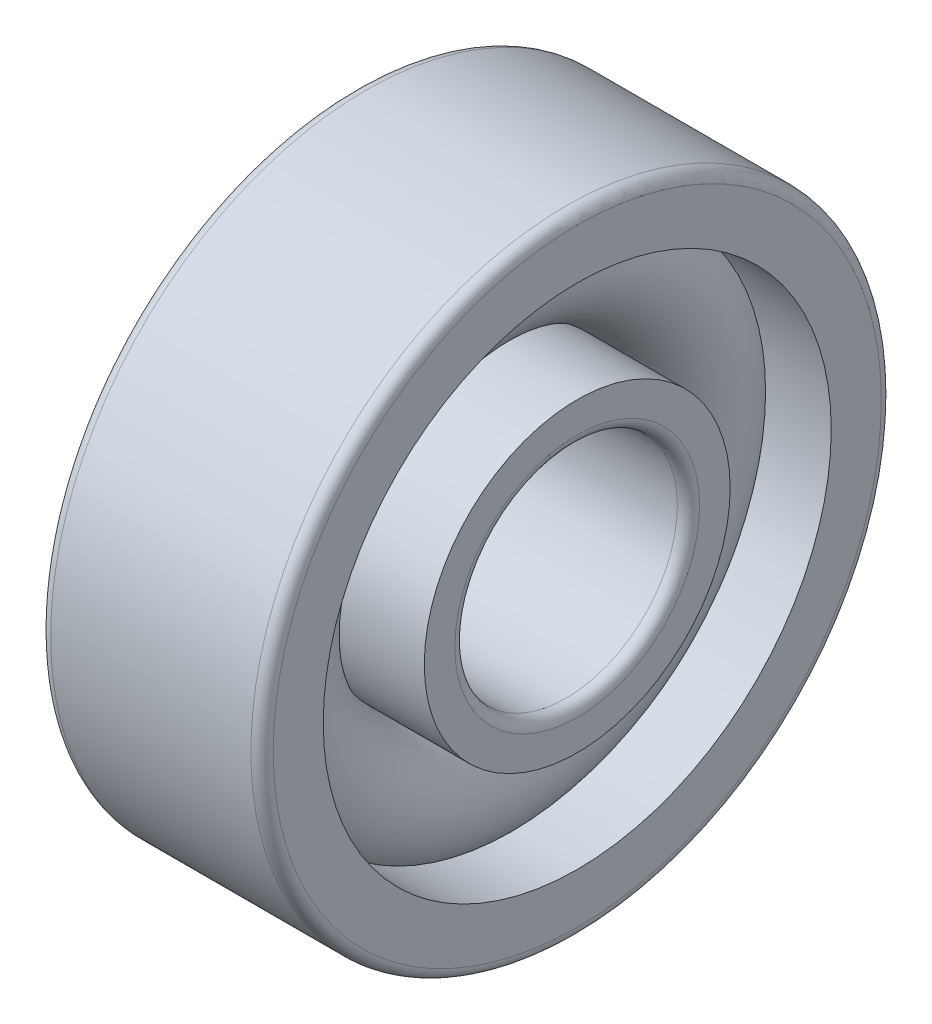
ISO-10303-21;
HEADER;
FILE_DESCRIPTION(('STEP AP214'),'2;1');
FILE_NAME('part.step','',(''),(''),'','','');
FILE_SCHEMA(('AUTOMOTIVE_DESIGN { 1 0 10303 214 1 1 1 1 }'));
ENDSEC;
DATA;
#1=APPLICATION_CONTEXT('core data for automotive mechanical design processes');
#2=APPLICATION_PROTOCOL_DEFINITION('international standard','automotive_design',2000,#1);
#3=PRODUCT_CONTEXT('',#1,'mechanical');
#4=PRODUCT('Part','Part','',(#3));
#5=PRODUCT_RELATED_PRODUCT_CATEGORY('part','',(#4));
#6=PRODUCT_DEFINITION_FORMATION('','',#4);
#7=PRODUCT_DEFINITION_CONTEXT('part definition',#1,'design');
#8=PRODUCT_DEFINITION('design','',#6,#7);
#9=PRODUCT_DEFINITION_SHAPE('','',#8);
#10=(LENGTH_UNIT() NAMED_UNIT(*) SI_UNIT(.MILLI.,.METRE.));
#11=(NAMED_UNIT(*) PLANE_ANGLE_UNIT() SI_UNIT($,.RADIAN.));
#12=(NAMED_UNIT(*) SI_UNIT($,.STERADIAN.) SOLID_ANGLE_UNIT());
#13=UNCERTAINTY_MEASURE_WITH_UNIT(LENGTH_MEASURE(1.E-05),#10,'distance_accuracy_value','');
#14=(GEOMETRIC_REPRESENTATION_CONTEXT(3) GLOBAL_UNCERTAINTY_ASSIGNED_CONTEXT((#13)) GLOBAL_UNIT_ASSIGNED_CONTEXT((#10,
#11,#12)) REPRESENTATION_CONTEXT('',''));
#15=CARTESIAN_POINT('',(0.,0.,0.));
#16=DIRECTION('',(0.,0.,1.));
#17=DIRECTION('',(1.,0.,0.));
#18=AXIS2_PLACEMENT_3D('',#15,#16,#17);
#19=CARTESIAN_POINT('',(0.,0.,0.));
#20=DIRECTION('',(-1.,0.,0.));
#21=DIRECTION('',(0.,0.,1.));
#22=AXIS2_PLACEMENT_3D('',#19,#20,#21);
#23=TOROIDAL_SURFACE('',#22,5.75,1.65);
#24=CARTESIAN_POINT('',(1.22983738762489,0.,0.));
#25=DIRECTION('',(-1.,0.,0.));
#26=DIRECTION('',(0.,0.,1.));
#27=AXIS2_PLACEMENT_3D('',#24,#25,#26);
#28=CIRCLE('',#27,6.85);
#29=CARTESIAN_POINT('',(1.22983738762489,0.,6.85));
#30=VERTEX_POINT('',#29);
#31=EDGE_CURVE('E46',#30,#30,#28,.F.);
#32=ORIENTED_EDGE('',*,*,#31,.T.);
#33=EDGE_LOOP('',(#32));
#34=FACE_BOUND('',#33,.T.);
#35=CARTESIAN_POINT('',(0.286138078556493,0.,0.));
#36=DIRECTION('',(-1.,0.,0.));
#37=DIRECTION('',(0.,0.,1.));
#38=AXIS2_PLACEMENT_3D('',#35,#36,#37);
#39=CIRCLE('',#38,4.125);
#40=CARTESIAN_POINT('',(0.286138078556493,0.,4.125));
#41=VERTEX_POINT('',#40);
#42=EDGE_CURVE('E12',#41,#41,#39,.T.);
#43=ORIENTED_EDGE('',*,*,#42,.T.);
#44=EDGE_LOOP('',(#43));
#45=FACE_BOUND('',#44,.T.);
#46=ADVANCED_FACE('F42',(#34,#45),#23,.T.);
#47=CARTESIAN_POINT('',(-20.6375,0.,0.));
#48=DIRECTION('',(1.,0.,0.));
#49=DIRECTION('',(0.,0.,-1.));
#50=AXIS2_PLACEMENT_3D('',#47,#48,#49);
#51=CYLINDRICAL_SURFACE('',#50,4.125);
#52=CARTESIAN_POINT('',(3.,0.,0.));
#53=DIRECTION('',(1.,0.,0.));
#54=DIRECTION('',(0.,0.,-1.));
#55=AXIS2_PLACEMENT_3D('',#52,#53,#54);
#56=CIRCLE('',#55,4.125);
#57=CARTESIAN_POINT('',(3.,0.,-4.125));
#58=VERTEX_POINT('',#57);
#59=EDGE_CURVE('E55',#58,#58,#56,.T.);
#60=ORIENTED_EDGE('',*,*,#59,.F.);
#61=EDGE_LOOP('',(#60));
#62=FACE_BOUND('',#61,.T.);
#63=ORIENTED_EDGE('',*,*,#42,.F.);
#64=EDGE_LOOP('',(#63));
#65=FACE_BOUND('',#64,.T.);
#66=ADVANCED_FACE('F94',(#62,#65),#51,.T.);
#67=CARTESIAN_POINT('',(-20.6375,0.,0.));
#68=DIRECTION('',(1.,0.,0.));
#69=DIRECTION('',(0.,0.,-1.));
#70=AXIS2_PLACEMENT_3D('',#67,#68,#69);
#71=CYLINDRICAL_SURFACE('',#70,4.65);
#72=CARTESIAN_POINT('',(-3.,0.,0.));
#73=DIRECTION('',(1.,0.,0.));
#74=DIRECTION('',(0.,0.,-1.));
#75=AXIS2_PLACEMENT_3D('',#72,#73,#74);
#76=CIRCLE('',#75,4.65);
#77=CARTESIAN_POINT('',(-3.,0.,-4.65));
#78=VERTEX_POINT('',#77);
#79=EDGE_CURVE('E64',#78,#78,#76,.T.);
#80=ORIENTED_EDGE('',*,*,#79,.T.);
#81=EDGE_LOOP('',(#80));
#82=FACE_BOUND('',#81,.T.);
#83=CARTESIAN_POINT('',(-1.22983738762488,0.,0.));
#84=DIRECTION('',(1.,0.,0.));
#85=DIRECTION('',(0.,0.,-1.));
#86=AXIS2_PLACEMENT_3D('',#83,#84,#85);
#87=CIRCLE('',#86,4.65);
#88=CARTESIAN_POINT('',(-1.22983738762488,0.,-4.65));
#89=VERTEX_POINT('',#88);
#90=EDGE_CURVE('E50',#89,#89,#87,.T.);
#91=ORIENTED_EDGE('',*,*,#90,.F.);
#92=EDGE_LOOP('',(#91));
#93=FACE_BOUND('',#92,.T.);
#94=ADVANCED_FACE('F97',(#82,#93),#71,.T.);
#95=CARTESIAN_POINT('',(3.,3.3,0.));
#96=DIRECTION('',(1.,0.,0.));
#97=DIRECTION('',(0.,0.,-1.));
#98=AXIS2_PLACEMENT_3D('',#95,#96,#97);
#99=PLANE('',#98);
#100=ORIENTED_EDGE('',*,*,#59,.T.);
#101=EDGE_LOOP('',(#100));
#102=FACE_BOUND('',#101,.T.);
#103=CARTESIAN_POINT('',(3.,0.,0.));
#104=DIRECTION('',(1.,0.,0.));
#105=DIRECTION('',(0.,0.,-1.));
#106=AXIS2_PLACEMENT_3D('',#103,#104,#105);
#107=CIRCLE('',#106,3.3);
#108=CARTESIAN_POINT('',(3.,0.,-3.3));
#109=VERTEX_POINT('',#108);
#110=EDGE_CURVE('E86',#109,#109,#107,.T.);
#111=ORIENTED_EDGE('',*,*,#110,.F.);
#112=EDGE_LOOP('',(#111));
#113=FACE_BOUND('',#112,.T.);
#114=ADVANCED_FACE('F91',(#102,#113),#99,.T.);
#115=CARTESIAN_POINT('',(2.7,0.,0.));
#116=DIRECTION('',(1.,0.,0.));
#117=DIRECTION('',(0.,0.,-1.));
#118=AXIS2_PLACEMENT_3D('',#115,#116,#117);
#119=TOROIDAL_SURFACE('',#118,3.3,0.3);
#120=ORIENTED_EDGE('',*,*,#110,.T.);
#121=EDGE_LOOP('',(#120));
#122=FACE_BOUND('',#121,.T.);
#123=CARTESIAN_POINT('',(2.7,0.,0.));
#124=DIRECTION('',(1.,0.,0.));
#125=DIRECTION('',(0.,0.,-1.));
#126=AXIS2_PLACEMENT_3D('',#123,#124,#125);
#127=CIRCLE('',#126,3.);
#128=CARTESIAN_POINT('',(2.7,0.,-3.));
#129=VERTEX_POINT('',#128);
#130=EDGE_CURVE('E83',#129,#129,#127,.T.);
#131=ORIENTED_EDGE('',*,*,#130,.F.);
#132=EDGE_LOOP('',(#131));
#133=FACE_BOUND('',#132,.T.);
#134=ADVANCED_FACE('F108',(#122,#133),#119,.T.);
#135=CARTESIAN_POINT('',(-20.6375,0.,0.));
#136=DIRECTION('',(1.,0.,0.));
#137=DIRECTION('',(0.,0.,-1.));
#138=AXIS2_PLACEMENT_3D('',#135,#136,#137);
#139=CYLINDRICAL_SURFACE('',#138,3.);
#140=ORIENTED_EDGE('',*,*,#130,.T.);
#141=EDGE_LOOP('',(#140));
#142=FACE_BOUND('',#141,.T.);
#143=CARTESIAN_POINT('',(-2.7,0.,0.));
#144=DIRECTION('',(1.,0.,0.));
#145=DIRECTION('',(0.,0.,-1.));
#146=AXIS2_PLACEMENT_3D('',#143,#144,#145);
#147=CIRCLE('',#146,3.);
#148=CARTESIAN_POINT('',(-2.7,0.,-3.));
#149=VERTEX_POINT('',#148);
#150=EDGE_CURVE('E80',#149,#149,#147,.T.);
#151=ORIENTED_EDGE('',*,*,#150,.F.);
#152=EDGE_LOOP('',(#151));
#153=FACE_BOUND('',#152,.T.);
#154=ADVANCED_FACE('F111',(#142,#153),#139,.F.);
#155=CARTESIAN_POINT('',(-2.7,0.,0.));
#156=DIRECTION('',(1.,0.,0.));
#157=DIRECTION('',(0.,0.,-1.));
#158=AXIS2_PLACEMENT_3D('',#155,#156,#157);
#159=TOROIDAL_SURFACE('',#158,3.3,0.3);
#160=ORIENTED_EDGE('',*,*,#150,.T.);
#161=EDGE_LOOP('',(#160));
#162=FACE_BOUND('',#161,.T.);
#163=CARTESIAN_POINT('',(-3.,0.,0.));
#164=DIRECTION('',(1.,0.,0.));
#165=DIRECTION('',(0.,0.,-1.));
#166=AXIS2_PLACEMENT_3D('',#163,#164,#165);
#167=CIRCLE('',#166,3.3);
#168=CARTESIAN_POINT('',(-3.,0.,-3.3));
#169=VERTEX_POINT('',#168);
#170=EDGE_CURVE('E77',#169,#169,#167,.T.);
#171=ORIENTED_EDGE('',*,*,#170,.F.);
#172=EDGE_LOOP('',(#171));
#173=FACE_BOUND('',#172,.T.);
#174=ADVANCED_FACE('F115',(#162,#173),#159,.T.);
#175=CARTESIAN_POINT('',(-3.,4.65,0.));
#176=DIRECTION('',(-1.,0.,0.));
#177=DIRECTION('',(0.,0.,1.));
#178=AXIS2_PLACEMENT_3D('',#175,#176,#177);
#179=PLANE('',#178);
#180=ORIENTED_EDGE('',*,*,#170,.T.);
#181=EDGE_LOOP('',(#180));
#182=FACE_BOUND('',#181,.T.);
#183=ORIENTED_EDGE('',*,*,#79,.F.);
#184=EDGE_LOOP('',(#183));
#185=FACE_BOUND('',#184,.T.);
#186=ADVANCED_FACE('F119',(#182,#185),#179,.T.);
#187=CARTESIAN_POINT('',(-0.286138078556493,0.,0.));
#188=DIRECTION('',(1.,0.,0.));
#189=DIRECTION('',(0.,0.,-1.));
#190=AXIS2_PLACEMENT_3D('',#187,#188,#189);
#191=CIRCLE('',#190,7.375);
#192=CARTESIAN_POINT('',(-0.286138078556493,0.,-7.375));
#193=VERTEX_POINT('',#192);
#194=EDGE_CURVE('E58',#193,#193,#191,.F.);
#195=ORIENTED_EDGE('',*,*,#194,.T.);
#196=EDGE_LOOP('',(#195));
#197=FACE_BOUND('',#196,.T.);
#198=ORIENTED_EDGE('',*,*,#90,.T.);
#199=EDGE_LOOP('',(#198));
#200=FACE_BOUND('',#199,.T.);
#201=ADVANCED_FACE('F44',(#197,#200),#23,.T.);
#202=CARTESIAN_POINT('',(-20.6375,0.,0.));
#203=DIRECTION('',(1.,0.,0.));
#204=DIRECTION('',(0.,0.,-1.));
#205=AXIS2_PLACEMENT_3D('',#202,#203,#204);
#206=CYLINDRICAL_SURFACE('',#205,6.85);
#207=CARTESIAN_POINT('',(3.,0.,0.));
#208=DIRECTION('',(1.,0.,0.));
#209=DIRECTION('',(0.,0.,-1.));
#210=AXIS2_PLACEMENT_3D('',#207,#208,#209);
#211=CIRCLE('',#210,6.85);
#212=CARTESIAN_POINT('',(3.,0.,-6.85));
#213=VERTEX_POINT('',#212);
#214=EDGE_CURVE('E160',#213,#213,#211,.T.);
#215=ORIENTED_EDGE('',*,*,#214,.T.);
#216=EDGE_LOOP('',(#215));
#217=FACE_BOUND('',#216,.T.);
#218=ORIENTED_EDGE('',*,*,#31,.F.);
#219=EDGE_LOOP('',(#218));
#220=FACE_BOUND('',#219,.T.);
#221=ADVANCED_FACE('F141',(#217,#220),#206,.F.);
#222=CARTESIAN_POINT('',(-20.6375,0.,0.));
#223=DIRECTION('',(1.,0.,0.));
#224=DIRECTION('',(0.,0.,-1.));
#225=AXIS2_PLACEMENT_3D('',#222,#223,#224);
#226=CYLINDRICAL_SURFACE('',#225,7.375);
#227=CARTESIAN_POINT('',(-3.,0.,0.));
#228=DIRECTION('',(1.,0.,0.));
#229=DIRECTION('',(0.,0.,-1.));
#230=AXIS2_PLACEMENT_3D('',#227,#228,#229);
#231=CIRCLE('',#230,7.375);
#232=CARTESIAN_POINT('',(-3.,0.,-7.375));
#233=VERTEX_POINT('',#232);
#234=EDGE_CURVE('E155',#233,#233,#231,.T.);
#235=ORIENTED_EDGE('',*,*,#234,.F.);
#236=EDGE_LOOP('',(#235));
#237=FACE_BOUND('',#236,.T.);
#238=ORIENTED_EDGE('',*,*,#194,.F.);
#239=EDGE_LOOP('',(#238));
#240=FACE_BOUND('',#239,.T.);
#241=ADVANCED_FACE('F128',(#237,#240),#226,.F.);
#242=CARTESIAN_POINT('',(-2.7,0.,0.));
#243=DIRECTION('',(1.,0.,0.));
#244=DIRECTION('',(0.,0.,-1.));
#245=AXIS2_PLACEMENT_3D('',#242,#243,#244);
#246=TOROIDAL_SURFACE('',#245,8.2,0.3);
#247=CARTESIAN_POINT('',(-3.,0.,0.));
#248=DIRECTION('',(1.,0.,0.));
#249=DIRECTION('',(0.,0.,-1.));
#250=AXIS2_PLACEMENT_3D('',#247,#248,#249);
#251=CIRCLE('',#250,8.2);
#252=CARTESIAN_POINT('',(-3.,0.,-8.2));
#253=VERTEX_POINT('',#252);
#254=EDGE_CURVE('E158',#253,#253,#251,.T.);
#255=ORIENTED_EDGE('',*,*,#254,.T.);
#256=EDGE_LOOP('',(#255));
#257=FACE_BOUND('',#256,.T.);
#258=CARTESIAN_POINT('',(-2.7,0.,0.));
#259=DIRECTION('',(1.,0.,0.));
#260=DIRECTION('',(0.,0.,-1.));
#261=AXIS2_PLACEMENT_3D('',#258,#259,#260);
#262=CIRCLE('',#261,8.5);
#263=CARTESIAN_POINT('',(-2.7,0.,-8.5));
#264=VERTEX_POINT('',#263);
#265=EDGE_CURVE('E60',#264,#264,#262,.T.);
#266=ORIENTED_EDGE('',*,*,#265,.F.);
#267=EDGE_LOOP('',(#266));
#268=FACE_BOUND('',#267,.T.);
#269=ADVANCED_FACE('F124',(#257,#268),#246,.T.);
#270=CARTESIAN_POINT('',(-20.6375,0.,0.));
#271=DIRECTION('',(1.,0.,0.));
#272=DIRECTION('',(0.,0.,-1.));
#273=AXIS2_PLACEMENT_3D('',#270,#271,#272);
#274=CYLINDRICAL_SURFACE('',#273,8.5);
#275=ORIENTED_EDGE('',*,*,#265,.T.);
#276=EDGE_LOOP('',(#275));
#277=FACE_BOUND('',#276,.T.);
#278=CARTESIAN_POINT('',(2.7,0.,0.));
#279=DIRECTION('',(1.,0.,0.));
#280=DIRECTION('',(0.,0.,-1.));
#281=AXIS2_PLACEMENT_3D('',#278,#279,#280);
#282=CIRCLE('',#281,8.5);
#283=CARTESIAN_POINT('',(2.7,0.,-8.5));
#284=VERTEX_POINT('',#283);
#285=EDGE_CURVE('E66',#284,#284,#282,.T.);
#286=ORIENTED_EDGE('',*,*,#285,.F.);
#287=EDGE_LOOP('',(#286));
#288=FACE_BOUND('',#287,.T.);
#289=ADVANCED_FACE('F127',(#277,#288),#274,.T.);
#290=CARTESIAN_POINT('',(2.7,0.,0.));
#291=DIRECTION('',(1.,0.,0.));
#292=DIRECTION('',(0.,0.,-1.));
#293=AXIS2_PLACEMENT_3D('',#290,#291,#292);
#294=TOROIDAL_SURFACE('',#293,8.2,0.3);
#295=ORIENTED_EDGE('',*,*,#285,.T.);
#296=EDGE_LOOP('',(#295));
#297=FACE_BOUND('',#296,.T.);
#298=CARTESIAN_POINT('',(3.,0.,0.));
#299=DIRECTION('',(1.,0.,0.));
#300=DIRECTION('',(0.,0.,-1.));
#301=AXIS2_PLACEMENT_3D('',#298,#299,#300);
#302=CIRCLE('',#301,8.2);
#303=CARTESIAN_POINT('',(3.,0.,-8.2));
#304=VERTEX_POINT('',#303);
#305=EDGE_CURVE('E71',#304,#304,#302,.T.);
#306=ORIENTED_EDGE('',*,*,#305,.F.);
#307=EDGE_LOOP('',(#306));
#308=FACE_BOUND('',#307,.T.);
#309=ADVANCED_FACE('F132',(#297,#308),#294,.T.);
#310=CARTESIAN_POINT('',(3.,8.2,0.));
#311=DIRECTION('',(1.,0.,0.));
#312=DIRECTION('',(0.,0.,-1.));
#313=AXIS2_PLACEMENT_3D('',#310,#311,#312);
#314=PLANE('',#313);
#315=ORIENTED_EDGE('',*,*,#305,.T.);
#316=EDGE_LOOP('',(#315));
#317=FACE_BOUND('',#316,.T.);
#318=ORIENTED_EDGE('',*,*,#214,.F.);
#319=EDGE_LOOP('',(#318));
#320=FACE_BOUND('',#319,.T.);
#321=ADVANCED_FACE('F135',(#317,#320),#314,.T.);
#322=CARTESIAN_POINT('',(-3.,7.375,0.));
#323=DIRECTION('',(-1.,0.,0.));
#324=DIRECTION('',(0.,0.,1.));
#325=AXIS2_PLACEMENT_3D('',#322,#323,#324);
#326=PLANE('',#325);
#327=ORIENTED_EDGE('',*,*,#234,.T.);
#328=EDGE_LOOP('',(#327));
#329=FACE_BOUND('',#328,.T.);
#330=ORIENTED_EDGE('',*,*,#254,.F.);
#331=EDGE_LOOP('',(#330));
#332=FACE_BOUND('',#331,.T.);
#333=ADVANCED_FACE('F139',(#329,#332),#326,.T.);
#334=CLOSED_SHELL('',(#46,#66,#94,#114,#134,#154,#174,#186,#201,#221,#241,#269,#289,#309,#321,#333));
#335=MANIFOLD_SOLID_BREP('B2',#334);
#336=ADVANCED_BREP_SHAPE_REPRESENTATION('',(#18,#335),#14);
#337=SHAPE_DEFINITION_REPRESENTATION(#9,#336);
ENDSEC;
END-ISO-10303-21;
